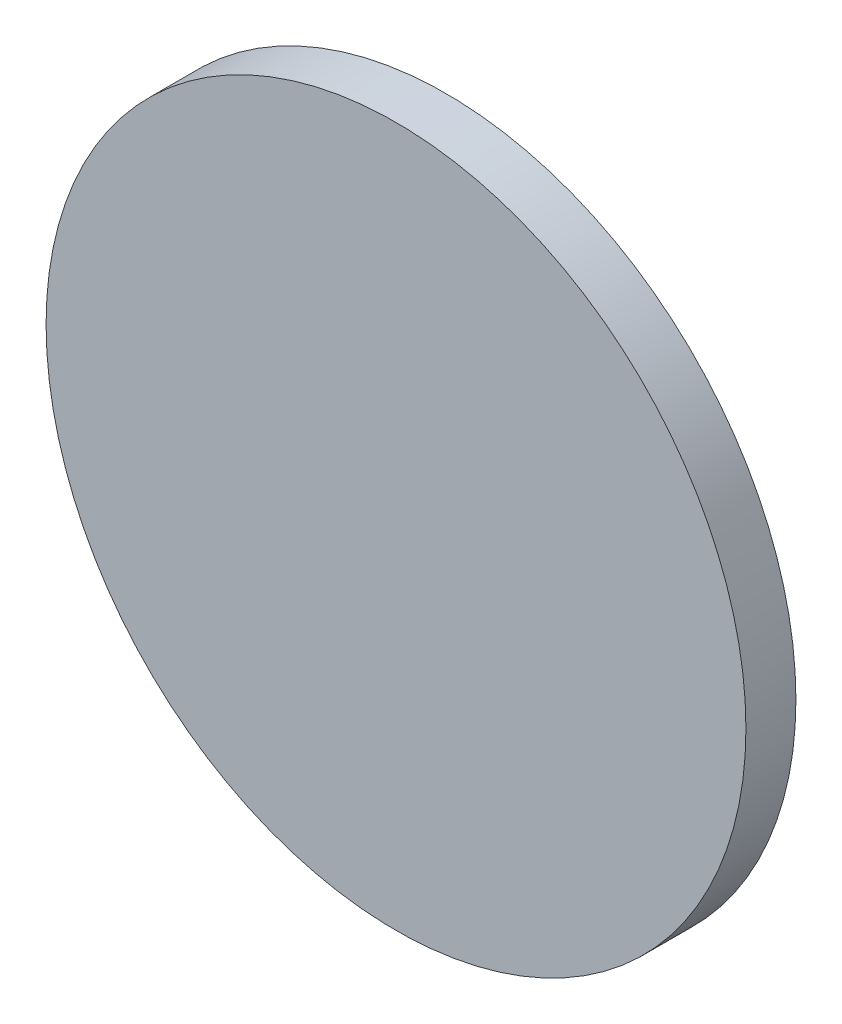
ISO-10303-21;
HEADER;
FILE_DESCRIPTION(('STEP AP214'),'2;1');
FILE_NAME('part.step','',(''),(''),'','','');
FILE_SCHEMA(('AUTOMOTIVE_DESIGN { 1 0 10303 214 1 1 1 1 }'));
ENDSEC;
DATA;
#1=APPLICATION_CONTEXT('core data for automotive mechanical design processes');
#2=APPLICATION_PROTOCOL_DEFINITION('international standard','automotive_design',2000,#1);
#3=PRODUCT_CONTEXT('',#1,'mechanical');
#4=PRODUCT('Part','Part','',(#3));
#5=PRODUCT_RELATED_PRODUCT_CATEGORY('part','',(#4));
#6=PRODUCT_DEFINITION_FORMATION('','',#4);
#7=PRODUCT_DEFINITION_CONTEXT('part definition',#1,'design');
#8=PRODUCT_DEFINITION('design','',#6,#7);
#9=PRODUCT_DEFINITION_SHAPE('','',#8);
#10=(LENGTH_UNIT() NAMED_UNIT(*) SI_UNIT(.MILLI.,.METRE.));
#11=(NAMED_UNIT(*) PLANE_ANGLE_UNIT() SI_UNIT($,.RADIAN.));
#12=(NAMED_UNIT(*) SI_UNIT($,.STERADIAN.) SOLID_ANGLE_UNIT());
#13=UNCERTAINTY_MEASURE_WITH_UNIT(LENGTH_MEASURE(1.E-05),#10,'distance_accuracy_value','');
#14=(GEOMETRIC_REPRESENTATION_CONTEXT(3) GLOBAL_UNCERTAINTY_ASSIGNED_CONTEXT((#13)) GLOBAL_UNIT_ASSIGNED_CONTEXT((#10,
#11,#12)) REPRESENTATION_CONTEXT('',''));
#15=CARTESIAN_POINT('',(0.,0.,0.));
#16=DIRECTION('',(0.,0.,1.));
#17=DIRECTION('',(1.,0.,0.));
#18=AXIS2_PLACEMENT_3D('',#15,#16,#17);
#19=CARTESIAN_POINT('',(37.5,0.,-0.7));
#20=DIRECTION('',(0.,0.,-1.));
#21=DIRECTION('',(-1.,0.,0.));
#22=AXIS2_PLACEMENT_3D('',#19,#20,#21);
#23=CYLINDRICAL_SURFACE('',#22,7.);
#24=CARTESIAN_POINT('',(37.5,0.,-0.7));
#25=DIRECTION('',(0.,0.,1.));
#26=DIRECTION('',(1.,0.,0.));
#27=AXIS2_PLACEMENT_3D('',#24,#25,#26);
#28=CIRCLE('',#27,7.);
#29=CARTESIAN_POINT('',(44.5,0.,-0.7));
#30=VERTEX_POINT('',#29);
#31=EDGE_CURVE('E10',#30,#30,#28,.T.);
#32=ORIENTED_EDGE('',*,*,#31,.F.);
#33=EDGE_LOOP('',(#32));
#34=FACE_BOUND('',#33,.T.);
#35=CARTESIAN_POINT('',(37.5,0.,-1.7));
#36=DIRECTION('',(0.,0.,1.));
#37=DIRECTION('',(1.,0.,0.));
#38=AXIS2_PLACEMENT_3D('',#35,#36,#37);
#39=CIRCLE('',#38,7.);
#40=CARTESIAN_POINT('',(44.5,0.,-1.7));
#41=VERTEX_POINT('',#40);
#42=EDGE_CURVE('E38',#41,#41,#39,.T.);
#43=ORIENTED_EDGE('',*,*,#42,.T.);
#44=EDGE_LOOP('',(#43));
#45=FACE_BOUND('',#44,.T.);
#46=ADVANCED_FACE('F35',(#34,#45),#23,.T.);
#47=CARTESIAN_POINT('',(37.5,0.,-0.7));
#48=DIRECTION('',(0.,0.,1.));
#49=DIRECTION('',(1.,0.,0.));
#50=AXIS2_PLACEMENT_3D('',#47,#48,#49);
#51=PLANE('',#50);
#52=ORIENTED_EDGE('',*,*,#31,.T.);
#53=EDGE_LOOP('',(#52));
#54=FACE_BOUND('',#53,.T.);
#55=ADVANCED_FACE('F50',(#54),#51,.T.);
#56=CARTESIAN_POINT('',(37.5,0.,-1.7));
#57=DIRECTION('',(0.,0.,1.));
#58=DIRECTION('',(1.,0.,0.));
#59=AXIS2_PLACEMENT_3D('',#56,#57,#58);
#60=PLANE('',#59);
#61=ORIENTED_EDGE('',*,*,#42,.F.);
#62=EDGE_LOOP('',(#61));
#63=FACE_BOUND('',#62,.T.);
#64=ADVANCED_FACE('F48',(#63),#60,.F.);
#65=CLOSED_SHELL('',(#46,#55,#64));
#66=MANIFOLD_SOLID_BREP('B2',#65);
#67=ADVANCED_BREP_SHAPE_REPRESENTATION('',(#18,#66),#14);
#68=SHAPE_DEFINITION_REPRESENTATION(#9,#67);
ENDSEC;
END-ISO-10303-21;
